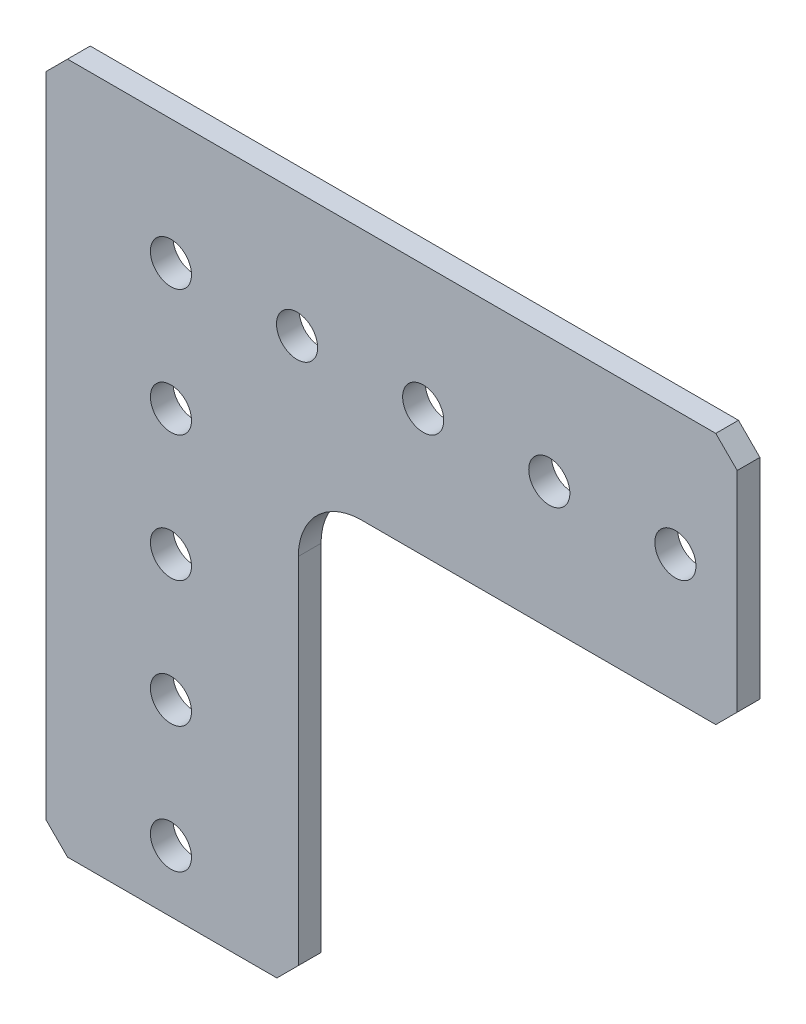
ISO-10303-21;
HEADER;
FILE_DESCRIPTION(('STEP AP214'),'2;1');
FILE_NAME('part.step','',(''),(''),'','','');
FILE_SCHEMA(('AUTOMOTIVE_DESIGN { 1 0 10303 214 1 1 1 1 }'));
ENDSEC;
DATA;
#1=APPLICATION_CONTEXT('core data for automotive mechanical design processes');
#2=APPLICATION_PROTOCOL_DEFINITION('international standard','automotive_design',2000,#1);
#3=PRODUCT_CONTEXT('',#1,'mechanical');
#4=PRODUCT('Part','Part','',(#3));
#5=PRODUCT_RELATED_PRODUCT_CATEGORY('part','',(#4));
#6=PRODUCT_DEFINITION_FORMATION('','',#4);
#7=PRODUCT_DEFINITION_CONTEXT('part definition',#1,'design');
#8=PRODUCT_DEFINITION('design','',#6,#7);
#9=PRODUCT_DEFINITION_SHAPE('','',#8);
#10=(LENGTH_UNIT() NAMED_UNIT(*) SI_UNIT(.MILLI.,.METRE.));
#11=(NAMED_UNIT(*) PLANE_ANGLE_UNIT() SI_UNIT($,.RADIAN.));
#12=(NAMED_UNIT(*) SI_UNIT($,.STERADIAN.) SOLID_ANGLE_UNIT());
#13=UNCERTAINTY_MEASURE_WITH_UNIT(LENGTH_MEASURE(1.E-05),#10,'distance_accuracy_value','');
#14=(GEOMETRIC_REPRESENTATION_CONTEXT(3) GLOBAL_UNCERTAINTY_ASSIGNED_CONTEXT((#13)) GLOBAL_UNIT_ASSIGNED_CONTEXT((#10,
#11,#12)) REPRESENTATION_CONTEXT('',''));
#15=CARTESIAN_POINT('',(0.,0.,0.));
#16=DIRECTION('',(0.,0.,1.));
#17=DIRECTION('',(1.,0.,0.));
#18=AXIS2_PLACEMENT_3D('',#15,#16,#17);
#19=CARTESIAN_POINT('',(-12.573,12.573,0.));
#20=DIRECTION('',(0.,0.,-1.));
#21=DIRECTION('',(-1.,0.,0.));
#22=AXIS2_PLACEMENT_3D('',#19,#20,#21);
#23=PLANE('',#22);
#24=DIRECTION('',(1.,0.,0.));
#25=VECTOR('',#24,1.);
#26=CARTESIAN_POINT('',(-12.573,12.573,0.));
#27=LINE('',#26,#25);
#28=CARTESIAN_POINT('',(-10.414,12.573,0.));
#29=VERTEX_POINT('',#28);
#30=CARTESIAN_POINT('',(54.864,12.573,0.));
#31=VERTEX_POINT('',#30);
#32=EDGE_CURVE('E144',#29,#31,#27,.T.);
#33=ORIENTED_EDGE('',*,*,#32,.T.);
#34=DIRECTION('',(0.707106781186549,-0.707106781186546,0.));
#35=VECTOR('',#34,1.);
#36=CARTESIAN_POINT('',(54.864,12.573,0.));
#37=LINE('',#36,#35);
#38=CARTESIAN_POINT('',(57.023,10.414,0.));
#39=VERTEX_POINT('',#38);
#40=EDGE_CURVE('E139',#31,#39,#37,.T.);
#41=ORIENTED_EDGE('',*,*,#40,.T.);
#42=DIRECTION('',(0.,-1.,0.));
#43=VECTOR('',#42,1.);
#44=CARTESIAN_POINT('',(57.023,12.573,0.));
#45=LINE('',#44,#43);
#46=CARTESIAN_POINT('',(57.023,-10.668,0.));
#47=VERTEX_POINT('',#46);
#48=EDGE_CURVE('E132',#39,#47,#45,.T.);
#49=ORIENTED_EDGE('',*,*,#48,.T.);
#50=DIRECTION('',(0.707106781186547,0.707106781186548,0.));
#51=VECTOR('',#50,1.);
#52=CARTESIAN_POINT('',(57.023,-10.668,0.));
#53=LINE('',#52,#51);
#54=CARTESIAN_POINT('',(54.864,-12.827,0.));
#55=VERTEX_POINT('',#54);
#56=EDGE_CURVE('E121',#55,#47,#53,.T.);
#57=ORIENTED_EDGE('',*,*,#56,.F.);
#58=DIRECTION('',(1.,0.,0.));
#59=VECTOR('',#58,1.);
#60=CARTESIAN_POINT('',(0.,-12.827,0.));
#61=LINE('',#60,#59);
#62=CARTESIAN_POINT('',(19.177,-12.827,0.));
#63=VERTEX_POINT('',#62);
#64=EDGE_CURVE('E115',#63,#55,#61,.T.);
#65=ORIENTED_EDGE('',*,*,#64,.F.);
#66=CARTESIAN_POINT('',(19.177,-19.177,0.));
#67=DIRECTION('',(0.,0.,1.));
#68=DIRECTION('',(1.,0.,0.));
#69=AXIS2_PLACEMENT_3D('',#66,#67,#68);
#70=CIRCLE('',#69,6.35);
#71=CARTESIAN_POINT('',(12.827,-19.177,0.));
#72=VERTEX_POINT('',#71);
#73=EDGE_CURVE('E103',#63,#72,#70,.T.);
#74=ORIENTED_EDGE('',*,*,#73,.T.);
#75=DIRECTION('',(0.,-1.,0.));
#76=VECTOR('',#75,1.);
#77=CARTESIAN_POINT('',(12.827,0.,0.));
#78=LINE('',#77,#76);
#79=CARTESIAN_POINT('',(12.827,-54.864,0.));
#80=VERTEX_POINT('',#79);
#81=EDGE_CURVE('E174',#72,#80,#78,.T.);
#82=ORIENTED_EDGE('',*,*,#81,.T.);
#83=DIRECTION('',(-0.707106781186547,-0.707106781186548,0.));
#84=VECTOR('',#83,1.);
#85=CARTESIAN_POINT('',(12.827,-54.864,0.));
#86=LINE('',#85,#84);
#87=CARTESIAN_POINT('',(10.668,-57.023,0.));
#88=VERTEX_POINT('',#87);
#89=EDGE_CURVE('E169',#80,#88,#86,.T.);
#90=ORIENTED_EDGE('',*,*,#89,.T.);
#91=DIRECTION('',(-1.,0.,0.));
#92=VECTOR('',#91,1.);
#93=CARTESIAN_POINT('',(12.827,-57.023,0.));
#94=LINE('',#93,#92);
#95=CARTESIAN_POINT('',(-10.414,-57.023,0.));
#96=VERTEX_POINT('',#95);
#97=EDGE_CURVE('E164',#88,#96,#94,.T.);
#98=ORIENTED_EDGE('',*,*,#97,.T.);
#99=DIRECTION('',(-0.707106781186548,0.707106781186548,0.));
#100=VECTOR('',#99,1.);
#101=CARTESIAN_POINT('',(-10.414,-57.023,0.));
#102=LINE('',#101,#100);
#103=CARTESIAN_POINT('',(-12.573,-54.864,0.));
#104=VERTEX_POINT('',#103);
#105=EDGE_CURVE('E159',#96,#104,#102,.T.);
#106=ORIENTED_EDGE('',*,*,#105,.T.);
#107=DIRECTION('',(0.,1.,0.));
#108=VECTOR('',#107,1.);
#109=CARTESIAN_POINT('',(-12.573,-57.023,0.));
#110=LINE('',#109,#108);
#111=CARTESIAN_POINT('',(-12.573,10.414,0.));
#112=VERTEX_POINT('',#111);
#113=EDGE_CURVE('E154',#104,#112,#110,.T.);
#114=ORIENTED_EDGE('',*,*,#113,.T.);
#115=DIRECTION('',(0.707106781186548,0.707106781186548,0.));
#116=VECTOR('',#115,1.);
#117=CARTESIAN_POINT('',(-12.573,10.414,0.));
#118=LINE('',#117,#116);
#119=EDGE_CURVE('E149',#112,#29,#118,.T.);
#120=ORIENTED_EDGE('',*,*,#119,.T.);
#121=EDGE_LOOP('',(#33,#41,#49,#57,#65,#74,#82,#90,#98,#106,#114,#120));
#122=FACE_BOUND('',#121,.T.);
#123=CARTESIAN_POINT('',(0.,-50.8,0.));
#124=DIRECTION('',(0.,0.,-1.));
#125=DIRECTION('',(-1.,0.,0.));
#126=AXIS2_PLACEMENT_3D('',#123,#124,#125);
#127=CIRCLE('',#126,2.0701);
#128=CARTESIAN_POINT('',(-2.07009999999999,-50.8,0.));
#129=VERTEX_POINT('',#128);
#130=EDGE_CURVE('E112',#129,#129,#127,.F.);
#131=ORIENTED_EDGE('',*,*,#130,.T.);
#132=EDGE_LOOP('',(#131));
#133=FACE_BOUND('',#132,.T.);
#134=CARTESIAN_POINT('',(2.66050878019847E-13,-25.4,0.));
#135=DIRECTION('',(0.,0.,-1.));
#136=DIRECTION('',(-1.,0.,0.));
#137=AXIS2_PLACEMENT_3D('',#134,#135,#136);
#138=CIRCLE('',#137,2.0701);
#139=CARTESIAN_POINT('',(-2.07009999999973,-25.4,0.));
#140=VERTEX_POINT('',#139);
#141=EDGE_CURVE('E209',#140,#140,#138,.F.);
#142=ORIENTED_EDGE('',*,*,#141,.T.);
#143=EDGE_LOOP('',(#142));
#144=FACE_BOUND('',#143,.T.);
#145=CARTESIAN_POINT('',(38.1,0.,0.));
#146=DIRECTION('',(0.,0.,-1.));
#147=DIRECTION('',(-1.,0.,0.));
#148=AXIS2_PLACEMENT_3D('',#145,#146,#147);
#149=CIRCLE('',#148,2.0701);
#150=CARTESIAN_POINT('',(36.0299,0.,0.));
#151=VERTEX_POINT('',#150);
#152=EDGE_CURVE('E212',#151,#151,#149,.F.);
#153=ORIENTED_EDGE('',*,*,#152,.T.);
#154=EDGE_LOOP('',(#153));
#155=FACE_BOUND('',#154,.T.);
#156=CARTESIAN_POINT('',(12.7,1.77367252013231E-13,0.));
#157=DIRECTION('',(0.,0.,-1.));
#158=DIRECTION('',(-1.,0.,0.));
#159=AXIS2_PLACEMENT_3D('',#156,#157,#158);
#160=CIRCLE('',#159,2.0701);
#161=CARTESIAN_POINT('',(10.6299,1.77367252013231E-13,0.));
#162=VERTEX_POINT('',#161);
#163=EDGE_CURVE('E215',#162,#162,#160,.F.);
#164=ORIENTED_EDGE('',*,*,#163,.T.);
#165=EDGE_LOOP('',(#164));
#166=FACE_BOUND('',#165,.T.);
#167=CARTESIAN_POINT('',(0.,0.,0.));
#168=DIRECTION('',(0.,0.,-1.));
#169=DIRECTION('',(-1.,0.,0.));
#170=AXIS2_PLACEMENT_3D('',#167,#168,#169);
#171=CIRCLE('',#170,2.0701);
#172=CARTESIAN_POINT('',(-2.0701,0.,0.));
#173=VERTEX_POINT('',#172);
#174=EDGE_CURVE('E218',#173,#173,#171,.F.);
#175=ORIENTED_EDGE('',*,*,#174,.T.);
#176=EDGE_LOOP('',(#175));
#177=FACE_BOUND('',#176,.T.);
#178=CARTESIAN_POINT('',(25.4,3.54734504026462E-13,0.));
#179=DIRECTION('',(0.,0.,-1.));
#180=DIRECTION('',(-1.,0.,0.));
#181=AXIS2_PLACEMENT_3D('',#178,#179,#180);
#182=CIRCLE('',#181,2.0701);
#183=CARTESIAN_POINT('',(23.3299,3.54734504026462E-13,0.));
#184=VERTEX_POINT('',#183);
#185=EDGE_CURVE('E221',#184,#184,#182,.F.);
#186=ORIENTED_EDGE('',*,*,#185,.T.);
#187=EDGE_LOOP('',(#186));
#188=FACE_BOUND('',#187,.T.);
#189=CARTESIAN_POINT('',(1.33025439009923E-13,-12.7,0.));
#190=DIRECTION('',(0.,0.,-1.));
#191=DIRECTION('',(-1.,0.,0.));
#192=AXIS2_PLACEMENT_3D('',#189,#190,#191);
#193=CIRCLE('',#192,2.0701);
#194=CARTESIAN_POINT('',(-2.07009999999987,-12.7,0.));
#195=VERTEX_POINT('',#194);
#196=EDGE_CURVE('E224',#195,#195,#193,.F.);
#197=ORIENTED_EDGE('',*,*,#196,.T.);
#198=EDGE_LOOP('',(#197));
#199=FACE_BOUND('',#198,.T.);
#200=CARTESIAN_POINT('',(3.9907631702977E-13,-38.1,0.));
#201=DIRECTION('',(0.,0.,-1.));
#202=DIRECTION('',(-1.,0.,0.));
#203=AXIS2_PLACEMENT_3D('',#200,#201,#202);
#204=CIRCLE('',#203,2.0701);
#205=CARTESIAN_POINT('',(-2.0700999999996,-38.1,0.));
#206=VERTEX_POINT('',#205);
#207=EDGE_CURVE('E226',#206,#206,#204,.F.);
#208=ORIENTED_EDGE('',*,*,#207,.T.);
#209=EDGE_LOOP('',(#208));
#210=FACE_BOUND('',#209,.T.);
#211=CARTESIAN_POINT('',(50.8,0.,0.));
#212=DIRECTION('',(0.,0.,-1.));
#213=DIRECTION('',(-1.,0.,0.));
#214=AXIS2_PLACEMENT_3D('',#211,#212,#213);
#215=CIRCLE('',#214,2.0701);
#216=CARTESIAN_POINT('',(48.7299,0.,0.));
#217=VERTEX_POINT('',#216);
#218=EDGE_CURVE('E20',#217,#217,#215,.F.);
#219=ORIENTED_EDGE('',*,*,#218,.T.);
#220=EDGE_LOOP('',(#219));
#221=FACE_BOUND('',#220,.T.);
#222=ADVANCED_FACE('F17',(#122,#133,#144,#155,#166,#177,#188,#199,#210,#221),#23,.T.);
#223=CARTESIAN_POINT('',(50.8,0.,2.286));
#224=DIRECTION('',(0.,0.,-1.));
#225=DIRECTION('',(-1.,0.,0.));
#226=AXIS2_PLACEMENT_3D('',#223,#224,#225);
#227=CYLINDRICAL_SURFACE('',#226,2.0701);
#228=ORIENTED_EDGE('',*,*,#218,.F.);
#229=EDGE_LOOP('',(#228));
#230=FACE_BOUND('',#229,.T.);
#231=CARTESIAN_POINT('',(50.8,0.,2.286));
#232=DIRECTION('',(0.,0.,-1.));
#233=DIRECTION('',(-1.,0.,0.));
#234=AXIS2_PLACEMENT_3D('',#231,#232,#233);
#235=CIRCLE('',#234,2.0701);
#236=CARTESIAN_POINT('',(48.7299,0.,2.286));
#237=VERTEX_POINT('',#236);
#238=EDGE_CURVE('E117',#237,#237,#235,.F.);
#239=ORIENTED_EDGE('',*,*,#238,.T.);
#240=EDGE_LOOP('',(#239));
#241=FACE_BOUND('',#240,.T.);
#242=ADVANCED_FACE('F234',(#230,#241),#227,.F.);
#243=CARTESIAN_POINT('',(3.9907631702977E-13,-38.1,2.286));
#244=DIRECTION('',(0.,0.,-1.));
#245=DIRECTION('',(-1.,0.,0.));
#246=AXIS2_PLACEMENT_3D('',#243,#244,#245);
#247=CYLINDRICAL_SURFACE('',#246,2.0701);
#248=ORIENTED_EDGE('',*,*,#207,.F.);
#249=EDGE_LOOP('',(#248));
#250=FACE_BOUND('',#249,.T.);
#251=CARTESIAN_POINT('',(3.9907631702977E-13,-38.1,2.286));
#252=DIRECTION('',(0.,0.,-1.));
#253=DIRECTION('',(-1.,0.,0.));
#254=AXIS2_PLACEMENT_3D('',#251,#252,#253);
#255=CIRCLE('',#254,2.0701);
#256=CARTESIAN_POINT('',(-2.0700999999996,-38.1,2.286));
#257=VERTEX_POINT('',#256);
#258=EDGE_CURVE('E202',#257,#257,#255,.F.);
#259=ORIENTED_EDGE('',*,*,#258,.T.);
#260=EDGE_LOOP('',(#259));
#261=FACE_BOUND('',#260,.T.);
#262=ADVANCED_FACE('F237',(#250,#261),#247,.F.);
#263=CARTESIAN_POINT('',(1.33025439009923E-13,-12.7,2.286));
#264=DIRECTION('',(0.,0.,-1.));
#265=DIRECTION('',(-1.,0.,0.));
#266=AXIS2_PLACEMENT_3D('',#263,#264,#265);
#267=CYLINDRICAL_SURFACE('',#266,2.0701);
#268=ORIENTED_EDGE('',*,*,#196,.F.);
#269=EDGE_LOOP('',(#268));
#270=FACE_BOUND('',#269,.T.);
#271=CARTESIAN_POINT('',(1.33025439009923E-13,-12.7,2.286));
#272=DIRECTION('',(0.,0.,-1.));
#273=DIRECTION('',(-1.,0.,0.));
#274=AXIS2_PLACEMENT_3D('',#271,#272,#273);
#275=CIRCLE('',#274,2.0701);
#276=CARTESIAN_POINT('',(-2.07009999999987,-12.7,2.286));
#277=VERTEX_POINT('',#276);
#278=EDGE_CURVE('E199',#277,#277,#275,.F.);
#279=ORIENTED_EDGE('',*,*,#278,.T.);
#280=EDGE_LOOP('',(#279));
#281=FACE_BOUND('',#280,.T.);
#282=ADVANCED_FACE('F317',(#270,#281),#267,.F.);
#283=CARTESIAN_POINT('',(25.4,3.54734504026462E-13,2.286));
#284=DIRECTION('',(0.,0.,-1.));
#285=DIRECTION('',(-1.,0.,0.));
#286=AXIS2_PLACEMENT_3D('',#283,#284,#285);
#287=CYLINDRICAL_SURFACE('',#286,2.0701);
#288=ORIENTED_EDGE('',*,*,#185,.F.);
#289=EDGE_LOOP('',(#288));
#290=FACE_BOUND('',#289,.T.);
#291=CARTESIAN_POINT('',(25.4,3.54734504026462E-13,2.286));
#292=DIRECTION('',(0.,0.,-1.));
#293=DIRECTION('',(-1.,0.,0.));
#294=AXIS2_PLACEMENT_3D('',#291,#292,#293);
#295=CIRCLE('',#294,2.0701);
#296=CARTESIAN_POINT('',(23.3299,3.54734504026462E-13,2.286));
#297=VERTEX_POINT('',#296);
#298=EDGE_CURVE('E196',#297,#297,#295,.F.);
#299=ORIENTED_EDGE('',*,*,#298,.T.);
#300=EDGE_LOOP('',(#299));
#301=FACE_BOUND('',#300,.T.);
#302=ADVANCED_FACE('F313',(#290,#301),#287,.F.);
#303=CARTESIAN_POINT('',(0.,0.,2.286));
#304=DIRECTION('',(0.,0.,-1.));
#305=DIRECTION('',(-1.,0.,0.));
#306=AXIS2_PLACEMENT_3D('',#303,#304,#305);
#307=CYLINDRICAL_SURFACE('',#306,2.0701);
#308=ORIENTED_EDGE('',*,*,#174,.F.);
#309=EDGE_LOOP('',(#308));
#310=FACE_BOUND('',#309,.T.);
#311=CARTESIAN_POINT('',(0.,0.,2.286));
#312=DIRECTION('',(0.,0.,-1.));
#313=DIRECTION('',(-1.,0.,0.));
#314=AXIS2_PLACEMENT_3D('',#311,#312,#313);
#315=CIRCLE('',#314,2.0701);
#316=CARTESIAN_POINT('',(-2.0701,0.,2.286));
#317=VERTEX_POINT('',#316);
#318=EDGE_CURVE('E193',#317,#317,#315,.F.);
#319=ORIENTED_EDGE('',*,*,#318,.T.);
#320=EDGE_LOOP('',(#319));
#321=FACE_BOUND('',#320,.T.);
#322=ADVANCED_FACE('F309',(#310,#321),#307,.F.);
#323=CARTESIAN_POINT('',(12.7,1.77367252013231E-13,2.286));
#324=DIRECTION('',(0.,0.,-1.));
#325=DIRECTION('',(-1.,0.,0.));
#326=AXIS2_PLACEMENT_3D('',#323,#324,#325);
#327=CYLINDRICAL_SURFACE('',#326,2.0701);
#328=ORIENTED_EDGE('',*,*,#163,.F.);
#329=EDGE_LOOP('',(#328));
#330=FACE_BOUND('',#329,.T.);
#331=CARTESIAN_POINT('',(12.7,1.77367252013231E-13,2.286));
#332=DIRECTION('',(0.,0.,-1.));
#333=DIRECTION('',(-1.,0.,0.));
#334=AXIS2_PLACEMENT_3D('',#331,#332,#333);
#335=CIRCLE('',#334,2.0701);
#336=CARTESIAN_POINT('',(10.6299,1.77367252013231E-13,2.286));
#337=VERTEX_POINT('',#336);
#338=EDGE_CURVE('E190',#337,#337,#335,.F.);
#339=ORIENTED_EDGE('',*,*,#338,.T.);
#340=EDGE_LOOP('',(#339));
#341=FACE_BOUND('',#340,.T.);
#342=ADVANCED_FACE('F305',(#330,#341),#327,.F.);
#343=CARTESIAN_POINT('',(38.1,0.,2.286));
#344=DIRECTION('',(0.,0.,-1.));
#345=DIRECTION('',(-1.,0.,0.));
#346=AXIS2_PLACEMENT_3D('',#343,#344,#345);
#347=CYLINDRICAL_SURFACE('',#346,2.0701);
#348=ORIENTED_EDGE('',*,*,#152,.F.);
#349=EDGE_LOOP('',(#348));
#350=FACE_BOUND('',#349,.T.);
#351=CARTESIAN_POINT('',(38.1,0.,2.286));
#352=DIRECTION('',(0.,0.,-1.));
#353=DIRECTION('',(-1.,0.,0.));
#354=AXIS2_PLACEMENT_3D('',#351,#352,#353);
#355=CIRCLE('',#354,2.0701);
#356=CARTESIAN_POINT('',(36.0299,0.,2.286));
#357=VERTEX_POINT('',#356);
#358=EDGE_CURVE('E187',#357,#357,#355,.F.);
#359=ORIENTED_EDGE('',*,*,#358,.T.);
#360=EDGE_LOOP('',(#359));
#361=FACE_BOUND('',#360,.T.);
#362=ADVANCED_FACE('F301',(#350,#361),#347,.F.);
#363=CARTESIAN_POINT('',(2.66050878019847E-13,-25.4,2.286));
#364=DIRECTION('',(0.,0.,-1.));
#365=DIRECTION('',(-1.,0.,0.));
#366=AXIS2_PLACEMENT_3D('',#363,#364,#365);
#367=CYLINDRICAL_SURFACE('',#366,2.0701);
#368=ORIENTED_EDGE('',*,*,#141,.F.);
#369=EDGE_LOOP('',(#368));
#370=FACE_BOUND('',#369,.T.);
#371=CARTESIAN_POINT('',(2.66050878019847E-13,-25.4,2.286));
#372=DIRECTION('',(0.,0.,-1.));
#373=DIRECTION('',(-1.,0.,0.));
#374=AXIS2_PLACEMENT_3D('',#371,#372,#373);
#375=CIRCLE('',#374,2.0701);
#376=CARTESIAN_POINT('',(-2.07009999999973,-25.4,2.286));
#377=VERTEX_POINT('',#376);
#378=EDGE_CURVE('E184',#377,#377,#375,.F.);
#379=ORIENTED_EDGE('',*,*,#378,.T.);
#380=EDGE_LOOP('',(#379));
#381=FACE_BOUND('',#380,.T.);
#382=ADVANCED_FACE('F297',(#370,#381),#367,.F.);
#383=CARTESIAN_POINT('',(0.,-50.8,2.286));
#384=DIRECTION('',(0.,0.,-1.));
#385=DIRECTION('',(-1.,0.,0.));
#386=AXIS2_PLACEMENT_3D('',#383,#384,#385);
#387=CYLINDRICAL_SURFACE('',#386,2.0701);
#388=ORIENTED_EDGE('',*,*,#130,.F.);
#389=EDGE_LOOP('',(#388));
#390=FACE_BOUND('',#389,.T.);
#391=CARTESIAN_POINT('',(0.,-50.8,2.286));
#392=DIRECTION('',(0.,0.,-1.));
#393=DIRECTION('',(-1.,0.,0.));
#394=AXIS2_PLACEMENT_3D('',#391,#392,#393);
#395=CIRCLE('',#394,2.0701);
#396=CARTESIAN_POINT('',(-2.07009999999999,-50.8,2.286));
#397=VERTEX_POINT('',#396);
#398=EDGE_CURVE('E181',#397,#397,#395,.F.);
#399=ORIENTED_EDGE('',*,*,#398,.T.);
#400=EDGE_LOOP('',(#399));
#401=FACE_BOUND('',#400,.T.);
#402=ADVANCED_FACE('F294',(#390,#401),#387,.F.);
#403=CARTESIAN_POINT('',(19.177,-19.177,0.));
#404=DIRECTION('',(0.,0.,1.));
#405=DIRECTION('',(1.,0.,0.));
#406=AXIS2_PLACEMENT_3D('',#403,#404,#405);
#407=CYLINDRICAL_SURFACE('',#406,6.35);
#408=DIRECTION('',(0.,0.,1.));
#409=VECTOR('',#408,1.);
#410=CARTESIAN_POINT('',(12.827,-19.177,0.));
#411=LINE('',#410,#409);
#412=CARTESIAN_POINT('',(12.827,-19.177,2.286));
#413=VERTEX_POINT('',#412);
#414=EDGE_CURVE('E108',#413,#72,#411,.F.);
#415=ORIENTED_EDGE('',*,*,#414,.T.);
#416=ORIENTED_EDGE('',*,*,#73,.F.);
#417=DIRECTION('',(0.,0.,-1.));
#418=VECTOR('',#417,1.);
#419=CARTESIAN_POINT('',(19.177,-12.827,0.));
#420=LINE('',#419,#418);
#421=CARTESIAN_POINT('',(19.177,-12.827,2.286));
#422=VERTEX_POINT('',#421);
#423=EDGE_CURVE('E107',#422,#63,#420,.T.);
#424=ORIENTED_EDGE('',*,*,#423,.F.);
#425=CARTESIAN_POINT('',(19.177,-19.177,2.286));
#426=DIRECTION('',(0.,0.,1.));
#427=DIRECTION('',(1.,0.,0.));
#428=AXIS2_PLACEMENT_3D('',#425,#426,#427);
#429=CIRCLE('',#428,6.35);
#430=EDGE_CURVE('E178',#422,#413,#429,.T.);
#431=ORIENTED_EDGE('',*,*,#430,.T.);
#432=EDGE_LOOP('',(#415,#416,#424,#431));
#433=FACE_BOUND('',#432,.T.);
#434=ADVANCED_FACE('F105',(#433),#407,.F.);
#435=CARTESIAN_POINT('',(12.827,0.,0.));
#436=DIRECTION('',(-1.,0.,0.));
#437=DIRECTION('',(0.,-1.,0.));
#438=AXIS2_PLACEMENT_3D('',#435,#436,#437);
#439=PLANE('',#438);
#440=DIRECTION('',(0.,0.,1.));
#441=VECTOR('',#440,1.);
#442=CARTESIAN_POINT('',(12.827,-54.864,0.));
#443=LINE('',#442,#441);
#444=CARTESIAN_POINT('',(12.827,-54.864,2.286));
#445=VERTEX_POINT('',#444);
#446=EDGE_CURVE('E171',#445,#80,#443,.F.);
#447=ORIENTED_EDGE('',*,*,#446,.T.);
#448=ORIENTED_EDGE('',*,*,#81,.F.);
#449=ORIENTED_EDGE('',*,*,#414,.F.);
#450=DIRECTION('',(0.,1.,0.));
#451=VECTOR('',#450,1.);
#452=CARTESIAN_POINT('',(12.827,12.573,2.286));
#453=LINE('',#452,#451);
#454=EDGE_CURVE('E180',#413,#445,#453,.F.);
#455=ORIENTED_EDGE('',*,*,#454,.T.);
#456=EDGE_LOOP('',(#447,#448,#449,#455));
#457=FACE_BOUND('',#456,.T.);
#458=ADVANCED_FACE('F287',(#457),#439,.F.);
#459=CARTESIAN_POINT('',(12.827,-54.864,0.));
#460=DIRECTION('',(-0.707106781186548,0.707106781186547,0.));
#461=DIRECTION('',(-0.707106781186547,-0.707106781186548,0.));
#462=AXIS2_PLACEMENT_3D('',#459,#460,#461);
#463=PLANE('',#462);
#464=DIRECTION('',(0.,0.,1.));
#465=VECTOR('',#464,1.);
#466=CARTESIAN_POINT('',(10.668,-57.023,2.286));
#467=LINE('',#466,#465);
#468=CARTESIAN_POINT('',(10.668,-57.023,2.286));
#469=VERTEX_POINT('',#468);
#470=EDGE_CURVE('E166',#469,#88,#467,.F.);
#471=ORIENTED_EDGE('',*,*,#470,.T.);
#472=ORIENTED_EDGE('',*,*,#89,.F.);
#473=ORIENTED_EDGE('',*,*,#446,.F.);
#474=DIRECTION('',(-0.70710678118655,-0.707106781186545,0.));
#475=VECTOR('',#474,1.);
#476=CARTESIAN_POINT('',(12.827,-54.864,2.286));
#477=LINE('',#476,#475);
#478=EDGE_CURVE('E518',#445,#469,#477,.T.);
#479=ORIENTED_EDGE('',*,*,#478,.T.);
#480=EDGE_LOOP('',(#471,#472,#473,#479));
#481=FACE_BOUND('',#480,.T.);
#482=ADVANCED_FACE('F283',(#481),#463,.F.);
#483=CARTESIAN_POINT('',(12.827,-57.023,2.286));
#484=DIRECTION('',(0.,1.,0.));
#485=DIRECTION('',(-1.,0.,0.));
#486=AXIS2_PLACEMENT_3D('',#483,#484,#485);
#487=PLANE('',#486);
#488=ORIENTED_EDGE('',*,*,#470,.F.);
#489=DIRECTION('',(-1.,0.,0.));
#490=VECTOR('',#489,1.);
#491=CARTESIAN_POINT('',(-12.573,-57.023,2.286));
#492=LINE('',#491,#490);
#493=CARTESIAN_POINT('',(-10.414,-57.023,2.286));
#494=VERTEX_POINT('',#493);
#495=EDGE_CURVE('E520',#469,#494,#492,.T.);
#496=ORIENTED_EDGE('',*,*,#495,.T.);
#497=DIRECTION('',(0.,0.,1.));
#498=VECTOR('',#497,1.);
#499=CARTESIAN_POINT('',(-10.414,-57.023,2.286));
#500=LINE('',#499,#498);
#501=EDGE_CURVE('E161',#494,#96,#500,.F.);
#502=ORIENTED_EDGE('',*,*,#501,.T.);
#503=ORIENTED_EDGE('',*,*,#97,.F.);
#504=EDGE_LOOP('',(#488,#496,#502,#503));
#505=FACE_BOUND('',#504,.T.);
#506=ADVANCED_FACE('F279',(#505),#487,.F.);
#507=CARTESIAN_POINT('',(-10.414,-57.023,2.286));
#508=DIRECTION('',(0.707106781186548,0.707106781186548,0.));
#509=DIRECTION('',(-0.707106781186548,0.707106781186548,0.));
#510=AXIS2_PLACEMENT_3D('',#507,#508,#509);
#511=PLANE('',#510);
#512=DIRECTION('',(0.,0.,1.));
#513=VECTOR('',#512,1.);
#514=CARTESIAN_POINT('',(-12.573,-54.864,2.286));
#515=LINE('',#514,#513);
#516=CARTESIAN_POINT('',(-12.573,-54.864,2.286));
#517=VERTEX_POINT('',#516);
#518=EDGE_CURVE('E156',#517,#104,#515,.F.);
#519=ORIENTED_EDGE('',*,*,#518,.T.);
#520=ORIENTED_EDGE('',*,*,#105,.F.);
#521=ORIENTED_EDGE('',*,*,#501,.F.);
#522=DIRECTION('',(-0.707106781186547,0.707106781186548,0.));
#523=VECTOR('',#522,1.);
#524=CARTESIAN_POINT('',(-10.414,-57.023,2.286));
#525=LINE('',#524,#523);
#526=EDGE_CURVE('E529',#494,#517,#525,.T.);
#527=ORIENTED_EDGE('',*,*,#526,.T.);
#528=EDGE_LOOP('',(#519,#520,#521,#527));
#529=FACE_BOUND('',#528,.T.);
#530=ADVANCED_FACE('F275',(#529),#511,.F.);
#531=CARTESIAN_POINT('',(-12.573,-57.023,2.286));
#532=DIRECTION('',(1.,0.,0.));
#533=DIRECTION('',(0.,1.,0.));
#534=AXIS2_PLACEMENT_3D('',#531,#532,#533);
#535=PLANE('',#534);
#536=ORIENTED_EDGE('',*,*,#518,.F.);
#537=DIRECTION('',(0.,1.,0.));
#538=VECTOR('',#537,1.);
#539=CARTESIAN_POINT('',(-12.573,12.573,2.286));
#540=LINE('',#539,#538);
#541=CARTESIAN_POINT('',(-12.573,10.414,2.286));
#542=VERTEX_POINT('',#541);
#543=EDGE_CURVE('E538',#517,#542,#540,.T.);
#544=ORIENTED_EDGE('',*,*,#543,.T.);
#545=DIRECTION('',(0.,0.,1.));
#546=VECTOR('',#545,1.);
#547=CARTESIAN_POINT('',(-12.573,10.414,2.286));
#548=LINE('',#547,#546);
#549=EDGE_CURVE('E151',#542,#112,#548,.F.);
#550=ORIENTED_EDGE('',*,*,#549,.T.);
#551=ORIENTED_EDGE('',*,*,#113,.F.);
#552=EDGE_LOOP('',(#536,#544,#550,#551));
#553=FACE_BOUND('',#552,.T.);
#554=ADVANCED_FACE('F271',(#553),#535,.F.);
#555=CARTESIAN_POINT('',(-12.573,10.414,2.286));
#556=DIRECTION('',(0.707106781186548,-0.707106781186548,0.));
#557=DIRECTION('',(0.707106781186548,0.707106781186548,0.));
#558=AXIS2_PLACEMENT_3D('',#555,#556,#557);
#559=PLANE('',#558);
#560=DIRECTION('',(0.,0.,-1.));
#561=VECTOR('',#560,1.);
#562=CARTESIAN_POINT('',(-10.414,12.573,2.286));
#563=LINE('',#562,#561);
#564=CARTESIAN_POINT('',(-10.414,12.573,2.286));
#565=VERTEX_POINT('',#564);
#566=EDGE_CURVE('E146',#565,#29,#563,.T.);
#567=ORIENTED_EDGE('',*,*,#566,.T.);
#568=ORIENTED_EDGE('',*,*,#119,.F.);
#569=ORIENTED_EDGE('',*,*,#549,.F.);
#570=DIRECTION('',(0.707106781186545,0.70710678118655,0.));
#571=VECTOR('',#570,1.);
#572=CARTESIAN_POINT('',(-12.573,10.414,2.286));
#573=LINE('',#572,#571);
#574=EDGE_CURVE('E547',#542,#565,#573,.T.);
#575=ORIENTED_EDGE('',*,*,#574,.T.);
#576=EDGE_LOOP('',(#567,#568,#569,#575));
#577=FACE_BOUND('',#576,.T.);
#578=ADVANCED_FACE('F267',(#577),#559,.F.);
#579=CARTESIAN_POINT('',(-12.573,12.573,2.286));
#580=DIRECTION('',(0.,-1.,0.));
#581=DIRECTION('',(0.,0.,-1.));
#582=AXIS2_PLACEMENT_3D('',#579,#580,#581);
#583=PLANE('',#582);
#584=ORIENTED_EDGE('',*,*,#566,.F.);
#585=DIRECTION('',(-1.,0.,0.));
#586=VECTOR('',#585,1.);
#587=CARTESIAN_POINT('',(-12.573,12.573,2.286));
#588=LINE('',#587,#586);
#589=CARTESIAN_POINT('',(54.864,12.573,2.286));
#590=VERTEX_POINT('',#589);
#591=EDGE_CURVE('E556',#565,#590,#588,.F.);
#592=ORIENTED_EDGE('',*,*,#591,.T.);
#593=DIRECTION('',(0.,0.,1.));
#594=VECTOR('',#593,1.);
#595=CARTESIAN_POINT('',(54.864,12.573,2.286));
#596=LINE('',#595,#594);
#597=EDGE_CURVE('E141',#590,#31,#596,.F.);
#598=ORIENTED_EDGE('',*,*,#597,.T.);
#599=ORIENTED_EDGE('',*,*,#32,.F.);
#600=EDGE_LOOP('',(#584,#592,#598,#599));
#601=FACE_BOUND('',#600,.T.);
#602=ADVANCED_FACE('F263',(#601),#583,.F.);
#603=CARTESIAN_POINT('',(54.864,12.573,2.286));
#604=DIRECTION('',(-0.707106781186546,-0.707106781186549,0.));
#605=DIRECTION('',(0.707106781186549,-0.707106781186546,0.));
#606=AXIS2_PLACEMENT_3D('',#603,#604,#605);
#607=PLANE('',#606);
#608=DIRECTION('',(0.,0.,1.));
#609=VECTOR('',#608,1.);
#610=CARTESIAN_POINT('',(57.023,10.414,2.286));
#611=LINE('',#610,#609);
#612=CARTESIAN_POINT('',(57.023,10.414,2.286));
#613=VERTEX_POINT('',#612);
#614=EDGE_CURVE('E136',#613,#39,#611,.F.);
#615=ORIENTED_EDGE('',*,*,#614,.T.);
#616=ORIENTED_EDGE('',*,*,#40,.F.);
#617=ORIENTED_EDGE('',*,*,#597,.F.);
#618=DIRECTION('',(0.707106781186551,-0.707106781186544,0.));
#619=VECTOR('',#618,1.);
#620=CARTESIAN_POINT('',(54.864,12.573,2.286));
#621=LINE('',#620,#619);
#622=EDGE_CURVE('E565',#590,#613,#621,.T.);
#623=ORIENTED_EDGE('',*,*,#622,.T.);
#624=EDGE_LOOP('',(#615,#616,#617,#623));
#625=FACE_BOUND('',#624,.T.);
#626=ADVANCED_FACE('F259',(#625),#607,.F.);
#627=CARTESIAN_POINT('',(57.023,12.573,2.286));
#628=DIRECTION('',(-1.,0.,0.));
#629=DIRECTION('',(0.,-1.,0.));
#630=AXIS2_PLACEMENT_3D('',#627,#628,#629);
#631=PLANE('',#630);
#632=DIRECTION('',(0.,0.,1.));
#633=VECTOR('',#632,1.);
#634=CARTESIAN_POINT('',(57.023,-10.668,2.286));
#635=LINE('',#634,#633);
#636=CARTESIAN_POINT('',(57.023,-10.668,2.286));
#637=VERTEX_POINT('',#636);
#638=EDGE_CURVE('E122',#47,#637,#635,.T.);
#639=ORIENTED_EDGE('',*,*,#638,.F.);
#640=ORIENTED_EDGE('',*,*,#48,.F.);
#641=ORIENTED_EDGE('',*,*,#614,.F.);
#642=DIRECTION('',(0.,1.,0.));
#643=VECTOR('',#642,1.);
#644=CARTESIAN_POINT('',(57.023,12.573,2.286));
#645=LINE('',#644,#643);
#646=EDGE_CURVE('E574',#613,#637,#645,.F.);
#647=ORIENTED_EDGE('',*,*,#646,.T.);
#648=EDGE_LOOP('',(#639,#640,#641,#647));
#649=FACE_BOUND('',#648,.T.);
#650=ADVANCED_FACE('F255',(#649),#631,.F.);
#651=CARTESIAN_POINT('',(57.023,-10.668,2.286));
#652=DIRECTION('',(0.707106781186548,-0.707106781186547,0.));
#653=DIRECTION('',(0.707106781186547,0.707106781186548,0.));
#654=AXIS2_PLACEMENT_3D('',#651,#652,#653);
#655=PLANE('',#654);
#656=ORIENTED_EDGE('',*,*,#56,.T.);
#657=ORIENTED_EDGE('',*,*,#638,.T.);
#658=DIRECTION('',(-0.707106781186544,-0.707106781186551,0.));
#659=VECTOR('',#658,1.);
#660=CARTESIAN_POINT('',(57.023,-10.668,2.286));
#661=LINE('',#660,#659);
#662=CARTESIAN_POINT('',(54.864,-12.827,2.286));
#663=VERTEX_POINT('',#662);
#664=EDGE_CURVE('E26',#637,#663,#661,.T.);
#665=ORIENTED_EDGE('',*,*,#664,.T.);
#666=DIRECTION('',(0.,0.,-1.));
#667=VECTOR('',#666,1.);
#668=CARTESIAN_POINT('',(54.864,-12.827,0.));
#669=LINE('',#668,#667);
#670=EDGE_CURVE('E34',#55,#663,#669,.F.);
#671=ORIENTED_EDGE('',*,*,#670,.F.);
#672=EDGE_LOOP('',(#656,#657,#665,#671));
#673=FACE_BOUND('',#672,.T.);
#674=ADVANCED_FACE('F248',(#673),#655,.T.);
#675=CARTESIAN_POINT('',(0.,-12.827,0.));
#676=DIRECTION('',(0.,-1.,0.));
#677=DIRECTION('',(0.,0.,-1.));
#678=AXIS2_PLACEMENT_3D('',#675,#676,#677);
#679=PLANE('',#678);
#680=DIRECTION('',(-1.,0.,0.));
#681=VECTOR('',#680,1.);
#682=CARTESIAN_POINT('',(-12.573,-12.827,2.286));
#683=LINE('',#682,#681);
#684=EDGE_CURVE('E10',#663,#422,#683,.T.);
#685=ORIENTED_EDGE('',*,*,#684,.T.);
#686=ORIENTED_EDGE('',*,*,#423,.T.);
#687=ORIENTED_EDGE('',*,*,#64,.T.);
#688=ORIENTED_EDGE('',*,*,#670,.T.);
#689=EDGE_LOOP('',(#685,#686,#687,#688));
#690=FACE_BOUND('',#689,.T.);
#691=ADVANCED_FACE('F114',(#690),#679,.T.);
#692=CARTESIAN_POINT('',(-12.573,12.573,2.286));
#693=DIRECTION('',(0.,0.,-1.));
#694=DIRECTION('',(-1.,0.,0.));
#695=AXIS2_PLACEMENT_3D('',#692,#693,#694);
#696=PLANE('',#695);
#697=ORIENTED_EDGE('',*,*,#664,.F.);
#698=ORIENTED_EDGE('',*,*,#646,.F.);
#699=ORIENTED_EDGE('',*,*,#622,.F.);
#700=ORIENTED_EDGE('',*,*,#591,.F.);
#701=ORIENTED_EDGE('',*,*,#574,.F.);
#702=ORIENTED_EDGE('',*,*,#543,.F.);
#703=ORIENTED_EDGE('',*,*,#526,.F.);
#704=ORIENTED_EDGE('',*,*,#495,.F.);
#705=ORIENTED_EDGE('',*,*,#478,.F.);
#706=ORIENTED_EDGE('',*,*,#454,.F.);
#707=ORIENTED_EDGE('',*,*,#430,.F.);
#708=ORIENTED_EDGE('',*,*,#684,.F.);
#709=EDGE_LOOP('',(#697,#698,#699,#700,#701,#702,#703,#704,#705,#706,#707,#708));
#710=FACE_BOUND('',#709,.T.);
#711=ORIENTED_EDGE('',*,*,#398,.F.);
#712=EDGE_LOOP('',(#711));
#713=FACE_BOUND('',#712,.T.);
#714=ORIENTED_EDGE('',*,*,#378,.F.);
#715=EDGE_LOOP('',(#714));
#716=FACE_BOUND('',#715,.T.);
#717=ORIENTED_EDGE('',*,*,#358,.F.);
#718=EDGE_LOOP('',(#717));
#719=FACE_BOUND('',#718,.T.);
#720=ORIENTED_EDGE('',*,*,#338,.F.);
#721=EDGE_LOOP('',(#720));
#722=FACE_BOUND('',#721,.T.);
#723=ORIENTED_EDGE('',*,*,#318,.F.);
#724=EDGE_LOOP('',(#723));
#725=FACE_BOUND('',#724,.T.);
#726=ORIENTED_EDGE('',*,*,#298,.F.);
#727=EDGE_LOOP('',(#726));
#728=FACE_BOUND('',#727,.T.);
#729=ORIENTED_EDGE('',*,*,#278,.F.);
#730=EDGE_LOOP('',(#729));
#731=FACE_BOUND('',#730,.T.);
#732=ORIENTED_EDGE('',*,*,#258,.F.);
#733=EDGE_LOOP('',(#732));
#734=FACE_BOUND('',#733,.T.);
#735=ORIENTED_EDGE('',*,*,#238,.F.);
#736=EDGE_LOOP('',(#735));
#737=FACE_BOUND('',#736,.T.);
#738=ADVANCED_FACE('F240',(#710,#713,#716,#719,#722,#725,#728,#731,#734,#737),#696,.F.);
#739=CLOSED_SHELL('',(#222,#242,#262,#282,#302,#322,#342,#362,#382,#402,#434,#458,#482,#506,
#530,#554,#578,#602,#626,#650,#674,#691,#738));
#740=MANIFOLD_SOLID_BREP('B1',#739);
#741=ADVANCED_BREP_SHAPE_REPRESENTATION('',(#18,#740),#14);
#742=SHAPE_DEFINITION_REPRESENTATION(#9,#741);
ENDSEC;
END-ISO-10303-21;
